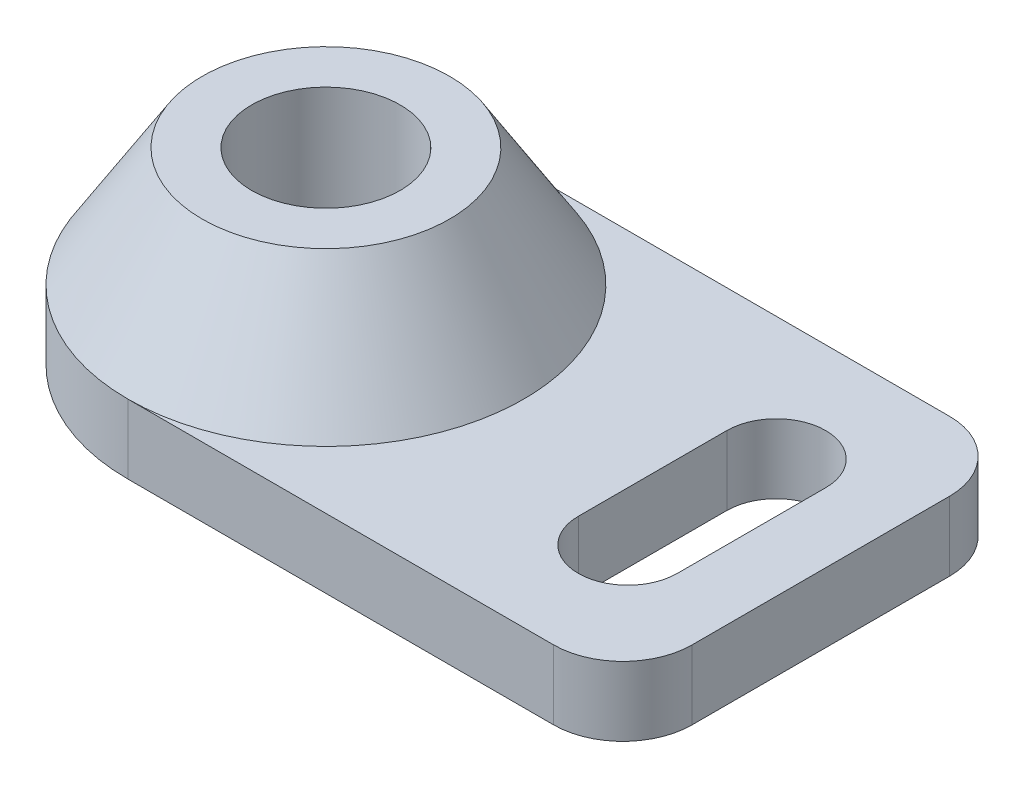
ISO-10303-21;
HEADER;
FILE_DESCRIPTION(('STEP AP214'),'2;1');
FILE_NAME('part.step','',(''),(''),'','','');
FILE_SCHEMA(('AUTOMOTIVE_DESIGN { 1 0 10303 214 1 1 1 1 }'));
ENDSEC;
DATA;
#1=APPLICATION_CONTEXT('core data for automotive mechanical design processes');
#2=APPLICATION_PROTOCOL_DEFINITION('international standard','automotive_design',2000,#1);
#3=PRODUCT_CONTEXT('',#1,'mechanical');
#4=PRODUCT('Part','Part','',(#3));
#5=PRODUCT_RELATED_PRODUCT_CATEGORY('part','',(#4));
#6=PRODUCT_DEFINITION_FORMATION('','',#4);
#7=PRODUCT_DEFINITION_CONTEXT('part definition',#1,'design');
#8=PRODUCT_DEFINITION('design','',#6,#7);
#9=PRODUCT_DEFINITION_SHAPE('','',#8);
#10=(LENGTH_UNIT() NAMED_UNIT(*) SI_UNIT(.MILLI.,.METRE.));
#11=(NAMED_UNIT(*) PLANE_ANGLE_UNIT() SI_UNIT($,.RADIAN.));
#12=(NAMED_UNIT(*) SI_UNIT($,.STERADIAN.) SOLID_ANGLE_UNIT());
#13=UNCERTAINTY_MEASURE_WITH_UNIT(LENGTH_MEASURE(1.E-05),#10,'distance_accuracy_value','');
#14=(GEOMETRIC_REPRESENTATION_CONTEXT(3) GLOBAL_UNCERTAINTY_ASSIGNED_CONTEXT((#13)) GLOBAL_UNIT_ASSIGNED_CONTEXT((#10,
#11,#12)) REPRESENTATION_CONTEXT('',''));
#15=CARTESIAN_POINT('',(0.,0.,0.));
#16=DIRECTION('',(0.,0.,1.));
#17=DIRECTION('',(1.,0.,0.));
#18=AXIS2_PLACEMENT_3D('',#15,#16,#17);
#19=CARTESIAN_POINT('',(0.,8.89,-25.4));
#20=DIRECTION('',(0.,1.,0.));
#21=DIRECTION('',(0.,0.,1.));
#22=AXIS2_PLACEMENT_3D('',#19,#20,#21);
#23=PLANE('',#22);
#24=CARTESIAN_POINT('',(48.26,8.89,-34.925));
#25=DIRECTION('',(0.,1.,0.));
#26=DIRECTION('',(0.,0.,1.));
#27=AXIS2_PLACEMENT_3D('',#24,#25,#26);
#28=CIRCLE('',#27,6.35);
#29=CARTESIAN_POINT('',(54.61,8.89,-34.925));
#30=VERTEX_POINT('',#29);
#31=CARTESIAN_POINT('',(41.91,8.89,-34.925));
#32=VERTEX_POINT('',#31);
#33=EDGE_CURVE('E277',#30,#32,#28,.T.);
#34=ORIENTED_EDGE('',*,*,#33,.F.);
#35=DIRECTION('',(0.,0.,-1.));
#36=VECTOR('',#35,1.);
#37=CARTESIAN_POINT('',(54.61,8.89,-34.925));
#38=LINE('',#37,#36);
#39=CARTESIAN_POINT('',(54.61,8.89,-15.875));
#40=VERTEX_POINT('',#39);
#41=EDGE_CURVE('E267',#40,#30,#38,.T.);
#42=ORIENTED_EDGE('',*,*,#41,.F.);
#43=CARTESIAN_POINT('',(48.26,8.89,-15.875));
#44=DIRECTION('',(0.,1.,0.));
#45=DIRECTION('',(0.,0.,1.));
#46=AXIS2_PLACEMENT_3D('',#43,#44,#45);
#47=CIRCLE('',#46,6.35);
#48=CARTESIAN_POINT('',(41.91,8.89,-15.875));
#49=VERTEX_POINT('',#48);
#50=EDGE_CURVE('E271',#49,#40,#47,.T.);
#51=ORIENTED_EDGE('',*,*,#50,.F.);
#52=DIRECTION('',(0.,0.,1.));
#53=VECTOR('',#52,1.);
#54=CARTESIAN_POINT('',(41.91,8.89,-34.925));
#55=LINE('',#54,#53);
#56=EDGE_CURVE('E274',#32,#49,#55,.T.);
#57=ORIENTED_EDGE('',*,*,#56,.F.);
#58=EDGE_LOOP('',(#34,#42,#51,#57));
#59=FACE_BOUND('',#58,.T.);
#60=DIRECTION('',(-1.,0.,0.));
#61=VECTOR('',#60,1.);
#62=CARTESIAN_POINT('',(0.,8.89,-50.8));
#63=LINE('',#62,#61);
#64=CARTESIAN_POINT('',(54.61,8.89,-50.8));
#65=VERTEX_POINT('',#64);
#66=CARTESIAN_POINT('',(0.000274441546231014,8.89,-50.8000000014871));
#67=VERTEX_POINT('',#66);
#68=EDGE_CURVE('E136',#65,#67,#63,.T.);
#69=ORIENTED_EDGE('',*,*,#68,.T.);
#70=CARTESIAN_POINT('',(0.,8.89,-25.4));
#71=DIRECTION('',(0.,1.,0.));
#72=DIRECTION('',(0.,0.,1.));
#73=AXIS2_PLACEMENT_3D('',#70,#71,#72);
#74=CIRCLE('',#73,25.4);
#75=CARTESIAN_POINT('',(0.,8.89,0.));
#76=VERTEX_POINT('',#75);
#77=EDGE_CURVE('E121',#76,#67,#74,.T.);
#78=ORIENTED_EDGE('',*,*,#77,.F.);
#79=DIRECTION('',(1.,0.,0.));
#80=VECTOR('',#79,1.);
#81=CARTESIAN_POINT('',(0.,8.89,0.));
#82=LINE('',#81,#80);
#83=CARTESIAN_POINT('',(54.61,8.89,0.));
#84=VERTEX_POINT('',#83);
#85=EDGE_CURVE('E157',#76,#84,#82,.T.);
#86=ORIENTED_EDGE('',*,*,#85,.T.);
#87=CARTESIAN_POINT('',(54.61,8.89,-8.89));
#88=DIRECTION('',(0.,1.,0.));
#89=DIRECTION('',(0.,0.,1.));
#90=AXIS2_PLACEMENT_3D('',#87,#88,#89);
#91=CIRCLE('',#90,8.89);
#92=CARTESIAN_POINT('',(63.5,8.89,-8.89));
#93=VERTEX_POINT('',#92);
#94=EDGE_CURVE('E242',#84,#93,#91,.T.);
#95=ORIENTED_EDGE('',*,*,#94,.T.);
#96=DIRECTION('',(0.,0.,-1.));
#97=VECTOR('',#96,1.);
#98=CARTESIAN_POINT('',(63.5,8.89,0.));
#99=LINE('',#98,#97);
#100=CARTESIAN_POINT('',(63.5,8.89,-41.91));
#101=VERTEX_POINT('',#100);
#102=EDGE_CURVE('E143',#93,#101,#99,.T.);
#103=ORIENTED_EDGE('',*,*,#102,.T.);
#104=CARTESIAN_POINT('',(54.61,8.89,-41.91));
#105=DIRECTION('',(0.,1.,0.));
#106=DIRECTION('',(0.,0.,1.));
#107=AXIS2_PLACEMENT_3D('',#104,#105,#106);
#108=CIRCLE('',#107,8.89);
#109=EDGE_CURVE('E50',#101,#65,#108,.T.);
#110=ORIENTED_EDGE('',*,*,#109,.T.);
#111=EDGE_LOOP('',(#69,#78,#86,#95,#103,#110));
#112=FACE_BOUND('',#111,.T.);
#113=ADVANCED_FACE('F41',(#59,#112),#23,.T.);
#114=CARTESIAN_POINT('',(0.,8.89,-25.4));
#115=DIRECTION('',(0.,-1.,0.));
#116=DIRECTION('',(0.,0.,-1.));
#117=AXIS2_PLACEMENT_3D('',#114,#115,#116);
#118=CYLINDRICAL_SURFACE('',#117,25.4);
#119=CARTESIAN_POINT('',(0.,0.,-25.4));
#120=DIRECTION('',(0.,1.,0.));
#121=DIRECTION('',(0.,0.,1.));
#122=AXIS2_PLACEMENT_3D('',#119,#120,#121);
#123=CIRCLE('',#122,25.4);
#124=CARTESIAN_POINT('',(0.,0.,-50.8));
#125=VERTEX_POINT('',#124);
#126=CARTESIAN_POINT('',(0.,0.,0.));
#127=VERTEX_POINT('',#126);
#128=EDGE_CURVE('E253',#125,#127,#123,.T.);
#129=ORIENTED_EDGE('',*,*,#128,.T.);
#130=DIRECTION('',(0.,-1.,0.));
#131=VECTOR('',#130,1.);
#132=CARTESIAN_POINT('',(0.,8.89,0.));
#133=LINE('',#132,#131);
#134=EDGE_CURVE('E152',#76,#127,#133,.T.);
#135=ORIENTED_EDGE('',*,*,#134,.F.);
#136=CARTESIAN_POINT('',(0.,8.89,-25.4));
#137=DIRECTION('',(0.,-1.,0.));
#138=DIRECTION('',(0.,0.,-1.));
#139=AXIS2_PLACEMENT_3D('',#136,#137,#138);
#140=CIRCLE('',#139,25.4);
#141=EDGE_CURVE('E127',#67,#76,#140,.F.);
#142=ORIENTED_EDGE('',*,*,#141,.F.);
#143=DIRECTION('',(0.,-1.,0.));
#144=VECTOR('',#143,1.);
#145=CARTESIAN_POINT('',(0.,8.89,-50.8));
#146=LINE('',#145,#144);
#147=EDGE_CURVE('E142',#67,#125,#146,.T.);
#148=ORIENTED_EDGE('',*,*,#147,.T.);
#149=EDGE_LOOP('',(#129,#135,#142,#148));
#150=FACE_BOUND('',#149,.T.);
#151=ADVANCED_FACE('F155',(#150),#118,.T.);
#152=CARTESIAN_POINT('',(0.,8.89,0.));
#153=DIRECTION('',(0.,0.,-1.));
#154=DIRECTION('',(-1.,0.,0.));
#155=AXIS2_PLACEMENT_3D('',#152,#153,#154);
#156=PLANE('',#155);
#157=DIRECTION('',(1.,0.,0.));
#158=VECTOR('',#157,1.);
#159=CARTESIAN_POINT('',(0.,0.,0.));
#160=LINE('',#159,#158);
#161=CARTESIAN_POINT('',(54.61,0.,0.));
#162=VERTEX_POINT('',#161);
#163=EDGE_CURVE('E251',#127,#162,#160,.T.);
#164=ORIENTED_EDGE('',*,*,#163,.T.);
#165=DIRECTION('',(0.,-1.,0.));
#166=VECTOR('',#165,1.);
#167=CARTESIAN_POINT('',(54.61,8.89,0.));
#168=LINE('',#167,#166);
#169=EDGE_CURVE('E12',#162,#84,#168,.F.);
#170=ORIENTED_EDGE('',*,*,#169,.T.);
#171=ORIENTED_EDGE('',*,*,#85,.F.);
#172=ORIENTED_EDGE('',*,*,#134,.T.);
#173=EDGE_LOOP('',(#164,#170,#171,#172));
#174=FACE_BOUND('',#173,.T.);
#175=ADVANCED_FACE('F252',(#174),#156,.F.);
#176=CARTESIAN_POINT('',(63.5,8.89,0.));
#177=DIRECTION('',(-1.,0.,0.));
#178=DIRECTION('',(0.,0.,1.));
#179=AXIS2_PLACEMENT_3D('',#176,#177,#178);
#180=PLANE('',#179);
#181=DIRECTION('',(0.,0.,-1.));
#182=VECTOR('',#181,1.);
#183=CARTESIAN_POINT('',(63.5,0.,0.));
#184=LINE('',#183,#182);
#185=CARTESIAN_POINT('',(63.5,0.,-8.89));
#186=VERTEX_POINT('',#185);
#187=CARTESIAN_POINT('',(63.5,0.,-41.91));
#188=VERTEX_POINT('',#187);
#189=EDGE_CURVE('E159',#186,#188,#184,.T.);
#190=ORIENTED_EDGE('',*,*,#189,.T.);
#191=DIRECTION('',(0.,-1.,0.));
#192=VECTOR('',#191,1.);
#193=CARTESIAN_POINT('',(63.5,8.89,-41.91));
#194=LINE('',#193,#192);
#195=EDGE_CURVE('E64',#188,#101,#194,.F.);
#196=ORIENTED_EDGE('',*,*,#195,.T.);
#197=ORIENTED_EDGE('',*,*,#102,.F.);
#198=DIRECTION('',(0.,-1.,0.));
#199=VECTOR('',#198,1.);
#200=CARTESIAN_POINT('',(63.5,8.89,-8.89));
#201=LINE('',#200,#199);
#202=EDGE_CURVE('E238',#93,#186,#201,.T.);
#203=ORIENTED_EDGE('',*,*,#202,.T.);
#204=EDGE_LOOP('',(#190,#196,#197,#203));
#205=FACE_BOUND('',#204,.T.);
#206=ADVANCED_FACE('F247',(#205),#180,.F.);
#207=CARTESIAN_POINT('',(0.,8.89,-50.8));
#208=DIRECTION('',(0.,0.,1.));
#209=DIRECTION('',(1.,0.,0.));
#210=AXIS2_PLACEMENT_3D('',#207,#208,#209);
#211=PLANE('',#210);
#212=ORIENTED_EDGE('',*,*,#68,.F.);
#213=DIRECTION('',(0.,-1.,0.));
#214=VECTOR('',#213,1.);
#215=CARTESIAN_POINT('',(54.61,8.89,-50.8));
#216=LINE('',#215,#214);
#217=CARTESIAN_POINT('',(54.61,0.,-50.8));
#218=VERTEX_POINT('',#217);
#219=EDGE_CURVE('E230',#65,#218,#216,.T.);
#220=ORIENTED_EDGE('',*,*,#219,.T.);
#221=DIRECTION('',(-1.,0.,0.));
#222=VECTOR('',#221,1.);
#223=CARTESIAN_POINT('',(0.,0.,-50.8));
#224=LINE('',#223,#222);
#225=EDGE_CURVE('E148',#218,#125,#224,.T.);
#226=ORIENTED_EDGE('',*,*,#225,.T.);
#227=ORIENTED_EDGE('',*,*,#147,.F.);
#228=EDGE_LOOP('',(#212,#220,#226,#227));
#229=FACE_BOUND('',#228,.T.);
#230=ADVANCED_FACE('F146',(#229),#211,.F.);
#231=CARTESIAN_POINT('',(0.,0.,-25.4));
#232=DIRECTION('',(0.,1.,0.));
#233=DIRECTION('',(0.,0.,1.));
#234=AXIS2_PLACEMENT_3D('',#231,#232,#233);
#235=PLANE('',#234);
#236=CARTESIAN_POINT('',(0.,0.,-25.4));
#237=DIRECTION('',(0.,1.,0.));
#238=DIRECTION('',(0.,0.,1.));
#239=AXIS2_PLACEMENT_3D('',#236,#237,#238);
#240=CIRCLE('',#239,9.525);
#241=CARTESIAN_POINT('',(0.,0.,-15.875));
#242=VERTEX_POINT('',#241);
#243=EDGE_CURVE('E131',#242,#242,#240,.T.);
#244=ORIENTED_EDGE('',*,*,#243,.T.);
#245=EDGE_LOOP('',(#244));
#246=FACE_BOUND('',#245,.T.);
#247=DIRECTION('',(0.,0.,-1.));
#248=VECTOR('',#247,1.);
#249=CARTESIAN_POINT('',(54.61,0.,-34.925));
#250=LINE('',#249,#248);
#251=CARTESIAN_POINT('',(54.61,0.,-15.875));
#252=VERTEX_POINT('',#251);
#253=CARTESIAN_POINT('',(54.61,0.,-34.925));
#254=VERTEX_POINT('',#253);
#255=EDGE_CURVE('E262',#252,#254,#250,.T.);
#256=ORIENTED_EDGE('',*,*,#255,.T.);
#257=CARTESIAN_POINT('',(48.26,0.,-34.925));
#258=DIRECTION('',(0.,1.,0.));
#259=DIRECTION('',(0.,0.,1.));
#260=AXIS2_PLACEMENT_3D('',#257,#258,#259);
#261=CIRCLE('',#260,6.35);
#262=CARTESIAN_POINT('',(41.91,0.,-34.925));
#263=VERTEX_POINT('',#262);
#264=EDGE_CURVE('E270',#254,#263,#261,.T.);
#265=ORIENTED_EDGE('',*,*,#264,.T.);
#266=DIRECTION('',(0.,0.,1.));
#267=VECTOR('',#266,1.);
#268=CARTESIAN_POINT('',(41.91,0.,-34.925));
#269=LINE('',#268,#267);
#270=CARTESIAN_POINT('',(41.91,0.,-15.875));
#271=VERTEX_POINT('',#270);
#272=EDGE_CURVE('E284',#263,#271,#269,.T.);
#273=ORIENTED_EDGE('',*,*,#272,.T.);
#274=CARTESIAN_POINT('',(48.26,0.,-15.875));
#275=DIRECTION('',(0.,1.,0.));
#276=DIRECTION('',(0.,0.,1.));
#277=AXIS2_PLACEMENT_3D('',#274,#275,#276);
#278=CIRCLE('',#277,6.35);
#279=EDGE_CURVE('E281',#271,#252,#278,.T.);
#280=ORIENTED_EDGE('',*,*,#279,.T.);
#281=EDGE_LOOP('',(#256,#265,#273,#280));
#282=FACE_BOUND('',#281,.T.);
#283=ORIENTED_EDGE('',*,*,#225,.F.);
#284=CARTESIAN_POINT('',(54.61,0.,-41.91));
#285=DIRECTION('',(0.,1.,0.));
#286=DIRECTION('',(0.,0.,1.));
#287=AXIS2_PLACEMENT_3D('',#284,#285,#286);
#288=CIRCLE('',#287,8.89);
#289=EDGE_CURVE('E233',#218,#188,#288,.F.);
#290=ORIENTED_EDGE('',*,*,#289,.T.);
#291=ORIENTED_EDGE('',*,*,#189,.F.);
#292=CARTESIAN_POINT('',(54.61,0.,-8.89));
#293=DIRECTION('',(0.,1.,0.));
#294=DIRECTION('',(0.,0.,1.));
#295=AXIS2_PLACEMENT_3D('',#292,#293,#294);
#296=CIRCLE('',#295,8.89);
#297=EDGE_CURVE('E231',#186,#162,#296,.F.);
#298=ORIENTED_EDGE('',*,*,#297,.T.);
#299=ORIENTED_EDGE('',*,*,#163,.F.);
#300=ORIENTED_EDGE('',*,*,#128,.F.);
#301=EDGE_LOOP('',(#283,#290,#291,#298,#299,#300));
#302=FACE_BOUND('',#301,.T.);
#303=ADVANCED_FACE('F209',(#246,#282,#302),#235,.F.);
#304=CARTESIAN_POINT('',(48.26,0.,-34.925));
#305=DIRECTION('',(0.,1.,0.));
#306=DIRECTION('',(0.,0.,1.));
#307=AXIS2_PLACEMENT_3D('',#304,#305,#306);
#308=CYLINDRICAL_SURFACE('',#307,6.35);
#309=ORIENTED_EDGE('',*,*,#33,.T.);
#310=DIRECTION('',(0.,1.,0.));
#311=VECTOR('',#310,1.);
#312=CARTESIAN_POINT('',(41.91,0.,-34.925));
#313=LINE('',#312,#311);
#314=EDGE_CURVE('E258',#263,#32,#313,.T.);
#315=ORIENTED_EDGE('',*,*,#314,.F.);
#316=ORIENTED_EDGE('',*,*,#264,.F.);
#317=DIRECTION('',(0.,1.,0.));
#318=VECTOR('',#317,1.);
#319=CARTESIAN_POINT('',(54.61,0.,-34.925));
#320=LINE('',#319,#318);
#321=EDGE_CURVE('E255',#254,#30,#320,.T.);
#322=ORIENTED_EDGE('',*,*,#321,.T.);
#323=EDGE_LOOP('',(#309,#315,#316,#322));
#324=FACE_BOUND('',#323,.T.);
#325=ADVANCED_FACE('F197',(#324),#308,.F.);
#326=CARTESIAN_POINT('',(54.61,0.,-34.925));
#327=DIRECTION('',(1.,0.,0.));
#328=DIRECTION('',(0.,0.,-1.));
#329=AXIS2_PLACEMENT_3D('',#326,#327,#328);
#330=PLANE('',#329);
#331=ORIENTED_EDGE('',*,*,#41,.T.);
#332=ORIENTED_EDGE('',*,*,#321,.F.);
#333=ORIENTED_EDGE('',*,*,#255,.F.);
#334=DIRECTION('',(0.,1.,0.));
#335=VECTOR('',#334,1.);
#336=CARTESIAN_POINT('',(54.61,0.,-15.875));
#337=LINE('',#336,#335);
#338=EDGE_CURVE('E264',#252,#40,#337,.T.);
#339=ORIENTED_EDGE('',*,*,#338,.T.);
#340=EDGE_LOOP('',(#331,#332,#333,#339));
#341=FACE_BOUND('',#340,.T.);
#342=ADVANCED_FACE('F193',(#341),#330,.F.);
#343=CARTESIAN_POINT('',(48.26,0.,-15.875));
#344=DIRECTION('',(0.,1.,0.));
#345=DIRECTION('',(0.,0.,1.));
#346=AXIS2_PLACEMENT_3D('',#343,#344,#345);
#347=CYLINDRICAL_SURFACE('',#346,6.35);
#348=ORIENTED_EDGE('',*,*,#50,.T.);
#349=ORIENTED_EDGE('',*,*,#338,.F.);
#350=ORIENTED_EDGE('',*,*,#279,.F.);
#351=DIRECTION('',(0.,1.,0.));
#352=VECTOR('',#351,1.);
#353=CARTESIAN_POINT('',(41.91,0.,-15.875));
#354=LINE('',#353,#352);
#355=EDGE_CURVE('E261',#271,#49,#354,.T.);
#356=ORIENTED_EDGE('',*,*,#355,.T.);
#357=EDGE_LOOP('',(#348,#349,#350,#356));
#358=FACE_BOUND('',#357,.T.);
#359=ADVANCED_FACE('F196',(#358),#347,.F.);
#360=CARTESIAN_POINT('',(41.91,0.,-34.925));
#361=DIRECTION('',(-1.,0.,0.));
#362=DIRECTION('',(0.,0.,1.));
#363=AXIS2_PLACEMENT_3D('',#360,#361,#362);
#364=PLANE('',#363);
#365=ORIENTED_EDGE('',*,*,#56,.T.);
#366=ORIENTED_EDGE('',*,*,#355,.F.);
#367=ORIENTED_EDGE('',*,*,#272,.F.);
#368=ORIENTED_EDGE('',*,*,#314,.T.);
#369=EDGE_LOOP('',(#365,#366,#367,#368));
#370=FACE_BOUND('',#369,.T.);
#371=ADVANCED_FACE('F201',(#370),#364,.F.);
#372=CARTESIAN_POINT('',(54.61,8.89,-41.91));
#373=DIRECTION('',(0.,-1.,0.));
#374=DIRECTION('',(0.,0.,-1.));
#375=AXIS2_PLACEMENT_3D('',#372,#373,#374);
#376=CYLINDRICAL_SURFACE('',#375,8.89);
#377=ORIENTED_EDGE('',*,*,#109,.F.);
#378=ORIENTED_EDGE('',*,*,#195,.F.);
#379=ORIENTED_EDGE('',*,*,#289,.F.);
#380=ORIENTED_EDGE('',*,*,#219,.F.);
#381=EDGE_LOOP('',(#377,#378,#379,#380));
#382=FACE_BOUND('',#381,.T.);
#383=ADVANCED_FACE('F205',(#382),#376,.T.);
#384=CARTESIAN_POINT('',(54.61,8.89,-8.89));
#385=DIRECTION('',(0.,-1.,0.));
#386=DIRECTION('',(0.,0.,-1.));
#387=AXIS2_PLACEMENT_3D('',#384,#385,#386);
#388=CYLINDRICAL_SURFACE('',#387,8.89);
#389=ORIENTED_EDGE('',*,*,#94,.F.);
#390=ORIENTED_EDGE('',*,*,#169,.F.);
#391=ORIENTED_EDGE('',*,*,#297,.F.);
#392=ORIENTED_EDGE('',*,*,#202,.F.);
#393=EDGE_LOOP('',(#389,#390,#391,#392));
#394=FACE_BOUND('',#393,.T.);
#395=ADVANCED_FACE('F43',(#394),#388,.T.);
#396=CARTESIAN_POINT('',(0.,24.13,-25.4));
#397=DIRECTION('',(0.,1.,0.));
#398=DIRECTION('',(0.,0.,1.));
#399=AXIS2_PLACEMENT_3D('',#396,#397,#398);
#400=PLANE('',#399);
#401=CARTESIAN_POINT('',(0.,24.13,-25.4));
#402=DIRECTION('',(0.,1.,0.));
#403=DIRECTION('',(0.,0.,1.));
#404=AXIS2_PLACEMENT_3D('',#401,#402,#403);
#405=CIRCLE('',#404,9.525);
#406=CARTESIAN_POINT('',(0.,24.13,-15.875));
#407=VERTEX_POINT('',#406);
#408=EDGE_CURVE('E306',#407,#407,#405,.T.);
#409=ORIENTED_EDGE('',*,*,#408,.F.);
#410=EDGE_LOOP('',(#409));
#411=FACE_BOUND('',#410,.T.);
#412=CARTESIAN_POINT('',(0.,24.13,-25.4));
#413=DIRECTION('',(0.,1.,0.));
#414=DIRECTION('',(0.,0.,1.));
#415=AXIS2_PLACEMENT_3D('',#412,#413,#414);
#416=CIRCLE('',#415,15.875);
#417=CARTESIAN_POINT('',(0.,24.13,-9.525));
#418=VERTEX_POINT('',#417);
#419=EDGE_CURVE('E130',#418,#418,#416,.T.);
#420=ORIENTED_EDGE('',*,*,#419,.T.);
#421=EDGE_LOOP('',(#420));
#422=FACE_BOUND('',#421,.T.);
#423=ADVANCED_FACE('F181',(#411,#422),#400,.T.);
#424=CARTESIAN_POINT('',(0.,24.13,-25.4));
#425=DIRECTION('',(0.,-1.,0.));
#426=DIRECTION('',(0.,0.,-1.));
#427=AXIS2_PLACEMENT_3D('',#424,#425,#426);
#428=CONICAL_SURFACE('',#427,15.875,0.558599315343562);
#429=ORIENTED_EDGE('',*,*,#77,.T.);
#430=ORIENTED_EDGE('',*,*,#141,.T.);
#431=EDGE_LOOP('',(#429,#430));
#432=FACE_BOUND('',#431,.T.);
#433=ORIENTED_EDGE('',*,*,#419,.F.);
#434=EDGE_LOOP('',(#433));
#435=FACE_BOUND('',#434,.T.);
#436=ADVANCED_FACE('F124',(#432,#435),#428,.T.);
#437=CARTESIAN_POINT('',(0.,-2.50000000007189E-05,-25.4));
#438=DIRECTION('',(0.,1.,0.));
#439=DIRECTION('',(0.,0.,1.));
#440=AXIS2_PLACEMENT_3D('',#437,#438,#439);
#441=CYLINDRICAL_SURFACE('',#440,9.525);
#442=ORIENTED_EDGE('',*,*,#408,.T.);
#443=EDGE_LOOP('',(#442));
#444=FACE_BOUND('',#443,.T.);
#445=ORIENTED_EDGE('',*,*,#243,.F.);
#446=EDGE_LOOP('',(#445));
#447=FACE_BOUND('',#446,.T.);
#448=ADVANCED_FACE('F311',(#444,#447),#441,.F.);
#449=CLOSED_SHELL('',(#113,#151,#175,#206,#230,#303,#325,#342,#359,#371,#383,#395,#423,#436,#448));
#450=MANIFOLD_SOLID_BREP('B2',#449);
#451=ADVANCED_BREP_SHAPE_REPRESENTATION('',(#18,#450),#14);
#452=SHAPE_DEFINITION_REPRESENTATION(#9,#451);
ENDSEC;
END-ISO-10303-21;
